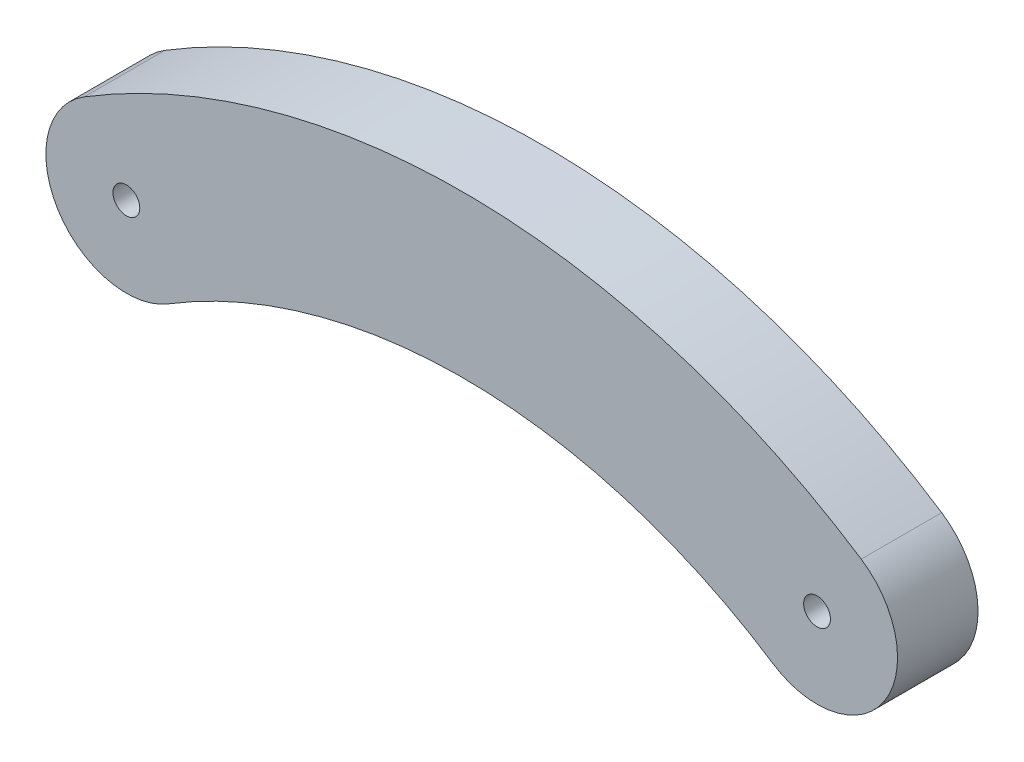
ISO-10303-21;
HEADER;
FILE_DESCRIPTION(('STEP AP214'),'2;1');
FILE_NAME('part.step','',(''),(''),'','','');
FILE_SCHEMA(('AUTOMOTIVE_DESIGN { 1 0 10303 214 1 1 1 1 }'));
ENDSEC;
DATA;
#1=APPLICATION_CONTEXT('core data for automotive mechanical design processes');
#2=APPLICATION_PROTOCOL_DEFINITION('international standard','automotive_design',2000,#1);
#3=PRODUCT_CONTEXT('',#1,'mechanical');
#4=PRODUCT('Part','Part','',(#3));
#5=PRODUCT_RELATED_PRODUCT_CATEGORY('part','',(#4));
#6=PRODUCT_DEFINITION_FORMATION('','',#4);
#7=PRODUCT_DEFINITION_CONTEXT('part definition',#1,'design');
#8=PRODUCT_DEFINITION('design','',#6,#7);
#9=PRODUCT_DEFINITION_SHAPE('','',#8);
#10=(LENGTH_UNIT() NAMED_UNIT(*) SI_UNIT(.MILLI.,.METRE.));
#11=(NAMED_UNIT(*) PLANE_ANGLE_UNIT() SI_UNIT($,.RADIAN.));
#12=(NAMED_UNIT(*) SI_UNIT($,.STERADIAN.) SOLID_ANGLE_UNIT());
#13=UNCERTAINTY_MEASURE_WITH_UNIT(LENGTH_MEASURE(1.E-05),#10,'distance_accuracy_value','');
#14=(GEOMETRIC_REPRESENTATION_CONTEXT(3) GLOBAL_UNCERTAINTY_ASSIGNED_CONTEXT((#13)) GLOBAL_UNIT_ASSIGNED_CONTEXT((#10,
#11,#12)) REPRESENTATION_CONTEXT('',''));
#15=CARTESIAN_POINT('',(0.,0.,0.));
#16=DIRECTION('',(0.,0.,1.));
#17=DIRECTION('',(1.,0.,0.));
#18=AXIS2_PLACEMENT_3D('',#15,#16,#17);
#19=CARTESIAN_POINT('',(8.42975006028058,-9.46112051223595,3.));
#20=DIRECTION('',(0.,0.,1.));
#21=DIRECTION('',(1.,0.,0.));
#22=AXIS2_PLACEMENT_3D('',#19,#20,#21);
#23=PLANE('',#22);
#24=CARTESIAN_POINT('',(-10.7230216208647,0.978784154642668,3.));
#25=DIRECTION('',(0.,0.,1.));
#26=DIRECTION('',(1.,0.,0.));
#27=AXIS2_PLACEMENT_3D('',#24,#25,#26);
#28=CIRCLE('',#27,0.500000000000001);
#29=CARTESIAN_POINT('',(-10.2230216208647,0.978784154642668,3.));
#30=VERTEX_POINT('',#29);
#31=EDGE_CURVE('E102',#30,#30,#28,.T.);
#32=ORIENTED_EDGE('',*,*,#31,.F.);
#33=EDGE_LOOP('',(#32));
#34=FACE_BOUND('',#33,.T.);
#35=CARTESIAN_POINT('',(15.0213800161225,0.584061224791557,3.));
#36=DIRECTION('',(0.,0.,1.));
#37=DIRECTION('',(1.,0.,0.));
#38=AXIS2_PLACEMENT_3D('',#35,#36,#37);
#39=CIRCLE('',#38,3.);
#40=CARTESIAN_POINT('',(13.3755015453305,-1.92414212808541,3.));
#41=VERTEX_POINT('',#40);
#42=CARTESIAN_POINT('',(16.6672584869146,3.09226457766852,3.));
#43=VERTEX_POINT('',#42);
#44=EDGE_CURVE('E87',#41,#43,#39,.T.);
#45=ORIENTED_EDGE('',*,*,#44,.T.);
#46=CARTESIAN_POINT('',(1.83812010443863,-19.5063022492634,3.));
#47=DIRECTION('',(0.,0.,1.));
#48=DIRECTION('',(1.,0.,0.));
#49=AXIS2_PLACEMENT_3D('',#46,#47,#48);
#50=CIRCLE('',#49,27.029586896546);
#51=CARTESIAN_POINT('',(-12.2912310677498,3.53626712246481,3.));
#52=VERTEX_POINT('',#51);
#53=EDGE_CURVE('E82',#43,#52,#50,.T.);
#54=ORIENTED_EDGE('',*,*,#53,.T.);
#55=CARTESIAN_POINT('',(-10.7230216208647,0.978784154642668,3.));
#56=DIRECTION('',(0.,0.,1.));
#57=DIRECTION('',(1.,0.,0.));
#58=AXIS2_PLACEMENT_3D('',#55,#56,#57);
#59=CIRCLE('',#58,3.);
#60=CARTESIAN_POINT('',(-9.15481217397956,-1.57869881317947,3.));
#61=VERTEX_POINT('',#60);
#62=EDGE_CURVE('E85',#52,#61,#59,.T.);
#63=ORIENTED_EDGE('',*,*,#62,.T.);
#64=CARTESIAN_POINT('',(1.83812010443863,-19.5063022492634,3.));
#65=DIRECTION('',(0.,0.,-1.));
#66=DIRECTION('',(1.,0.,0.));
#67=AXIS2_PLACEMENT_3D('',#64,#65,#66);
#68=CIRCLE('',#67,21.029586896546);
#69=EDGE_CURVE('E52',#61,#41,#68,.T.);
#70=ORIENTED_EDGE('',*,*,#69,.T.);
#71=EDGE_LOOP('',(#45,#54,#63,#70));
#72=FACE_BOUND('',#71,.T.);
#73=CARTESIAN_POINT('',(15.0213800161225,0.584061224791557,3.));
#74=DIRECTION('',(0.,0.,1.));
#75=DIRECTION('',(1.,0.,0.));
#76=AXIS2_PLACEMENT_3D('',#73,#74,#75);
#77=CIRCLE('',#76,0.500000000000001);
#78=CARTESIAN_POINT('',(15.5213800161225,0.584061224791557,3.));
#79=VERTEX_POINT('',#78);
#80=EDGE_CURVE('E117',#79,#79,#77,.T.);
#81=ORIENTED_EDGE('',*,*,#80,.F.);
#82=EDGE_LOOP('',(#81));
#83=FACE_BOUND('',#82,.T.);
#84=ADVANCED_FACE('F35',(#34,#72,#83),#23,.T.);
#85=CARTESIAN_POINT('',(8.42975006028058,-9.46112051223595,0.));
#86=DIRECTION('',(0.,0.,1.));
#87=DIRECTION('',(1.,0.,0.));
#88=AXIS2_PLACEMENT_3D('',#85,#86,#87);
#89=PLANE('',#88);
#90=CARTESIAN_POINT('',(15.0213800161225,0.584061224791557,0.));
#91=DIRECTION('',(0.,0.,1.));
#92=DIRECTION('',(1.,0.,0.));
#93=AXIS2_PLACEMENT_3D('',#90,#91,#92);
#94=CIRCLE('',#93,3.);
#95=CARTESIAN_POINT('',(13.3755015453305,-1.92414212808541,0.));
#96=VERTEX_POINT('',#95);
#97=CARTESIAN_POINT('',(16.6672584869146,3.09226457766852,0.));
#98=VERTEX_POINT('',#97);
#99=EDGE_CURVE('E99',#96,#98,#94,.T.);
#100=ORIENTED_EDGE('',*,*,#99,.F.);
#101=CARTESIAN_POINT('',(1.83812010443863,-19.5063022492634,0.));
#102=DIRECTION('',(0.,0.,-1.));
#103=DIRECTION('',(1.,0.,0.));
#104=AXIS2_PLACEMENT_3D('',#101,#102,#103);
#105=CIRCLE('',#104,21.029586896546);
#106=CARTESIAN_POINT('',(-9.15481217397956,-1.57869881317947,0.));
#107=VERTEX_POINT('',#106);
#108=EDGE_CURVE('E75',#107,#96,#105,.T.);
#109=ORIENTED_EDGE('',*,*,#108,.F.);
#110=CARTESIAN_POINT('',(-10.7230216208647,0.978784154642668,0.));
#111=DIRECTION('',(0.,0.,1.));
#112=DIRECTION('',(1.,0.,0.));
#113=AXIS2_PLACEMENT_3D('',#110,#111,#112);
#114=CIRCLE('',#113,3.);
#115=CARTESIAN_POINT('',(-12.2912310677498,3.53626712246481,0.));
#116=VERTEX_POINT('',#115);
#117=EDGE_CURVE('E69',#116,#107,#114,.T.);
#118=ORIENTED_EDGE('',*,*,#117,.F.);
#119=CARTESIAN_POINT('',(1.83812010443863,-19.5063022492634,0.));
#120=DIRECTION('',(0.,0.,1.));
#121=DIRECTION('',(1.,0.,0.));
#122=AXIS2_PLACEMENT_3D('',#119,#120,#121);
#123=CIRCLE('',#122,27.029586896546);
#124=EDGE_CURVE('E91',#98,#116,#123,.T.);
#125=ORIENTED_EDGE('',*,*,#124,.F.);
#126=EDGE_LOOP('',(#100,#109,#118,#125));
#127=FACE_BOUND('',#126,.T.);
#128=CARTESIAN_POINT('',(-10.7230216208647,0.978784154642668,0.));
#129=DIRECTION('',(0.,0.,1.));
#130=DIRECTION('',(1.,0.,0.));
#131=AXIS2_PLACEMENT_3D('',#128,#129,#130);
#132=CIRCLE('',#131,0.500000000000001);
#133=CARTESIAN_POINT('',(-10.2230216208647,0.978784154642668,0.));
#134=VERTEX_POINT('',#133);
#135=EDGE_CURVE('E114',#134,#134,#132,.T.);
#136=ORIENTED_EDGE('',*,*,#135,.T.);
#137=EDGE_LOOP('',(#136));
#138=FACE_BOUND('',#137,.T.);
#139=CARTESIAN_POINT('',(15.0213800161225,0.584061224791557,0.));
#140=DIRECTION('',(0.,0.,1.));
#141=DIRECTION('',(1.,0.,0.));
#142=AXIS2_PLACEMENT_3D('',#139,#140,#141);
#143=CIRCLE('',#142,0.500000000000001);
#144=CARTESIAN_POINT('',(15.5213800161225,0.584061224791557,0.));
#145=VERTEX_POINT('',#144);
#146=EDGE_CURVE('E120',#145,#145,#143,.T.);
#147=ORIENTED_EDGE('',*,*,#146,.T.);
#148=EDGE_LOOP('',(#147));
#149=FACE_BOUND('',#148,.T.);
#150=ADVANCED_FACE('F110',(#127,#138,#149),#89,.F.);
#151=CARTESIAN_POINT('',(15.0213800161225,0.584061224791557,3.));
#152=DIRECTION('',(0.,0.,-1.));
#153=DIRECTION('',(-1.,0.,0.));
#154=AXIS2_PLACEMENT_3D('',#151,#152,#153);
#155=CYLINDRICAL_SURFACE('',#154,3.);
#156=ORIENTED_EDGE('',*,*,#99,.T.);
#157=DIRECTION('',(0.,0.,-1.));
#158=VECTOR('',#157,1.);
#159=CARTESIAN_POINT('',(16.6672584869146,3.09226457766852,3.));
#160=LINE('',#159,#158);
#161=EDGE_CURVE('E11',#43,#98,#160,.T.);
#162=ORIENTED_EDGE('',*,*,#161,.F.);
#163=ORIENTED_EDGE('',*,*,#44,.F.);
#164=DIRECTION('',(0.,0.,-1.));
#165=VECTOR('',#164,1.);
#166=CARTESIAN_POINT('',(13.3755015453305,-1.92414212808541,3.));
#167=LINE('',#166,#165);
#168=EDGE_CURVE('E95',#41,#96,#167,.T.);
#169=ORIENTED_EDGE('',*,*,#168,.T.);
#170=EDGE_LOOP('',(#156,#162,#163,#169));
#171=FACE_BOUND('',#170,.T.);
#172=ADVANCED_FACE('F37',(#171),#155,.T.);
#173=CARTESIAN_POINT('',(1.83812010443863,-19.5063022492634,3.));
#174=DIRECTION('',(0.,0.,-1.));
#175=DIRECTION('',(-1.,0.,0.));
#176=AXIS2_PLACEMENT_3D('',#173,#174,#175);
#177=CYLINDRICAL_SURFACE('',#176,27.029586896546);
#178=ORIENTED_EDGE('',*,*,#124,.T.);
#179=DIRECTION('',(0.,0.,-1.));
#180=VECTOR('',#179,1.);
#181=CARTESIAN_POINT('',(-12.2912310677498,3.53626712246481,3.));
#182=LINE('',#181,#180);
#183=EDGE_CURVE('E44',#52,#116,#182,.T.);
#184=ORIENTED_EDGE('',*,*,#183,.F.);
#185=ORIENTED_EDGE('',*,*,#53,.F.);
#186=ORIENTED_EDGE('',*,*,#161,.T.);
#187=EDGE_LOOP('',(#178,#184,#185,#186));
#188=FACE_BOUND('',#187,.T.);
#189=ADVANCED_FACE('F90',(#188),#177,.T.);
#190=CARTESIAN_POINT('',(-10.7230216208647,0.978784154642668,3.));
#191=DIRECTION('',(0.,0.,-1.));
#192=DIRECTION('',(-1.,0.,0.));
#193=AXIS2_PLACEMENT_3D('',#190,#191,#192);
#194=CYLINDRICAL_SURFACE('',#193,3.);
#195=ORIENTED_EDGE('',*,*,#117,.T.);
#196=DIRECTION('',(0.,0.,-1.));
#197=VECTOR('',#196,1.);
#198=CARTESIAN_POINT('',(-9.15481217397956,-1.57869881317947,3.));
#199=LINE('',#198,#197);
#200=EDGE_CURVE('E92',#61,#107,#199,.T.);
#201=ORIENTED_EDGE('',*,*,#200,.F.);
#202=ORIENTED_EDGE('',*,*,#62,.F.);
#203=ORIENTED_EDGE('',*,*,#183,.T.);
#204=EDGE_LOOP('',(#195,#201,#202,#203));
#205=FACE_BOUND('',#204,.T.);
#206=ADVANCED_FACE('F93',(#205),#194,.T.);
#207=CARTESIAN_POINT('',(1.83812010443863,-19.5063022492634,3.));
#208=DIRECTION('',(0.,0.,-1.));
#209=DIRECTION('',(-1.,0.,0.));
#210=AXIS2_PLACEMENT_3D('',#207,#208,#209);
#211=CYLINDRICAL_SURFACE('',#210,21.029586896546);
#212=ORIENTED_EDGE('',*,*,#108,.T.);
#213=ORIENTED_EDGE('',*,*,#168,.F.);
#214=ORIENTED_EDGE('',*,*,#69,.F.);
#215=ORIENTED_EDGE('',*,*,#200,.T.);
#216=EDGE_LOOP('',(#212,#213,#214,#215));
#217=FACE_BOUND('',#216,.T.);
#218=ADVANCED_FACE('F107',(#217),#211,.F.);
#219=CARTESIAN_POINT('',(-10.7230216208647,0.978784154642668,3.));
#220=DIRECTION('',(0.,0.,-1.));
#221=DIRECTION('',(-1.,0.,0.));
#222=AXIS2_PLACEMENT_3D('',#219,#220,#221);
#223=CYLINDRICAL_SURFACE('',#222,0.500000000000001);
#224=ORIENTED_EDGE('',*,*,#31,.T.);
#225=EDGE_LOOP('',(#224));
#226=FACE_BOUND('',#225,.T.);
#227=ORIENTED_EDGE('',*,*,#135,.F.);
#228=EDGE_LOOP('',(#227));
#229=FACE_BOUND('',#228,.T.);
#230=ADVANCED_FACE('F137',(#226,#229),#223,.F.);
#231=CARTESIAN_POINT('',(15.0213800161225,0.584061224791557,3.));
#232=DIRECTION('',(0.,0.,-1.));
#233=DIRECTION('',(-1.,0.,0.));
#234=AXIS2_PLACEMENT_3D('',#231,#232,#233);
#235=CYLINDRICAL_SURFACE('',#234,0.500000000000001);
#236=ORIENTED_EDGE('',*,*,#80,.T.);
#237=EDGE_LOOP('',(#236));
#238=FACE_BOUND('',#237,.T.);
#239=ORIENTED_EDGE('',*,*,#146,.F.);
#240=EDGE_LOOP('',(#239));
#241=FACE_BOUND('',#240,.T.);
#242=ADVANCED_FACE('F126',(#238,#241),#235,.F.);
#243=CLOSED_SHELL('',(#84,#150,#172,#189,#206,#218,#230,#242));
#244=MANIFOLD_SOLID_BREP('B2',#243);
#245=ADVANCED_BREP_SHAPE_REPRESENTATION('',(#18,#244),#14);
#246=SHAPE_DEFINITION_REPRESENTATION(#9,#245);
ENDSEC;
END-ISO-10303-21;
